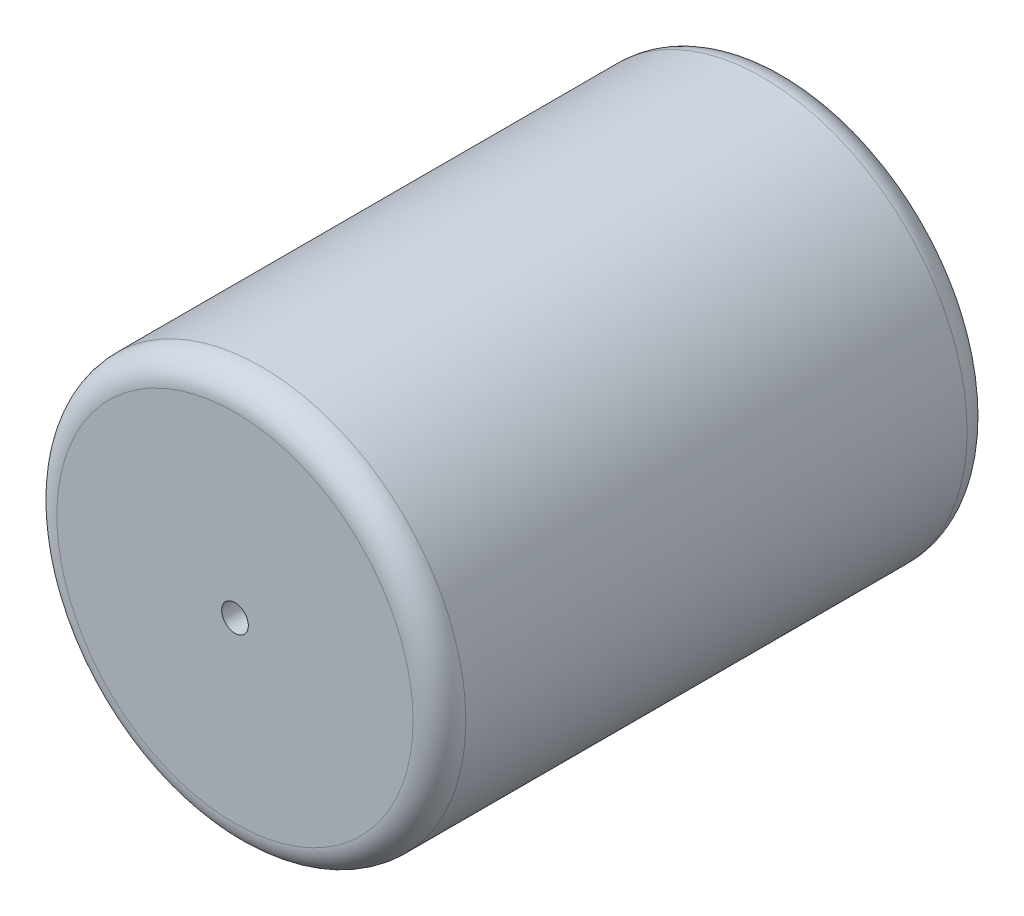
ISO-10303-21;
HEADER;
FILE_DESCRIPTION(('STEP AP214'),'2;1');
FILE_NAME('part.step','',(''),(''),'','','');
FILE_SCHEMA(('AUTOMOTIVE_DESIGN { 1 0 10303 214 1 1 1 1 }'));
ENDSEC;
DATA;
#1=APPLICATION_CONTEXT('core data for automotive mechanical design processes');
#2=APPLICATION_PROTOCOL_DEFINITION('international standard','automotive_design',2000,#1);
#3=PRODUCT_CONTEXT('',#1,'mechanical');
#4=PRODUCT('Part','Part','',(#3));
#5=PRODUCT_RELATED_PRODUCT_CATEGORY('part','',(#4));
#6=PRODUCT_DEFINITION_FORMATION('','',#4);
#7=PRODUCT_DEFINITION_CONTEXT('part definition',#1,'design');
#8=PRODUCT_DEFINITION('design','',#6,#7);
#9=PRODUCT_DEFINITION_SHAPE('','',#8);
#10=(LENGTH_UNIT() NAMED_UNIT(*) SI_UNIT(.MILLI.,.METRE.));
#11=(NAMED_UNIT(*) PLANE_ANGLE_UNIT() SI_UNIT($,.RADIAN.));
#12=(NAMED_UNIT(*) SI_UNIT($,.STERADIAN.) SOLID_ANGLE_UNIT());
#13=UNCERTAINTY_MEASURE_WITH_UNIT(LENGTH_MEASURE(1.E-05),#10,'distance_accuracy_value','');
#14=(GEOMETRIC_REPRESENTATION_CONTEXT(3) GLOBAL_UNCERTAINTY_ASSIGNED_CONTEXT((#13)) GLOBAL_UNIT_ASSIGNED_CONTEXT((#10,
#11,#12)) REPRESENTATION_CONTEXT('',''));
#15=CARTESIAN_POINT('',(0.,0.,0.));
#16=DIRECTION('',(0.,0.,1.));
#17=DIRECTION('',(1.,0.,0.));
#18=AXIS2_PLACEMENT_3D('',#15,#16,#17);
#19=CARTESIAN_POINT('',(0.,0.,21.));
#20=DIRECTION('',(0.,0.,-1.));
#21=DIRECTION('',(-1.,0.,0.));
#22=AXIS2_PLACEMENT_3D('',#19,#20,#21);
#23=CYLINDRICAL_SURFACE('',#22,7.75);
#24=CARTESIAN_POINT('',(0.,0.,20.));
#25=DIRECTION('',(0.,0.,1.));
#26=DIRECTION('',(1.,0.,0.));
#27=AXIS2_PLACEMENT_3D('',#24,#25,#26);
#28=CIRCLE('',#27,7.75);
#29=CARTESIAN_POINT('',(7.75,0.,20.));
#30=VERTEX_POINT('',#29);
#31=EDGE_CURVE('E40',#30,#30,#28,.F.);
#32=ORIENTED_EDGE('',*,*,#31,.T.);
#33=EDGE_LOOP('',(#32));
#34=FACE_BOUND('',#33,.T.);
#35=CARTESIAN_POINT('',(0.,0.,1.));
#36=DIRECTION('',(0.,0.,1.));
#37=DIRECTION('',(1.,0.,0.));
#38=AXIS2_PLACEMENT_3D('',#35,#36,#37);
#39=CIRCLE('',#38,7.75);
#40=CARTESIAN_POINT('',(7.75,0.,1.));
#41=VERTEX_POINT('',#40);
#42=EDGE_CURVE('E44',#41,#41,#39,.T.);
#43=ORIENTED_EDGE('',*,*,#42,.T.);
#44=EDGE_LOOP('',(#43));
#45=FACE_BOUND('',#44,.T.);
#46=ADVANCED_FACE('F32',(#34,#45),#23,.T.);
#47=CARTESIAN_POINT('',(0.,0.,21.));
#48=DIRECTION('',(0.,0.,1.));
#49=DIRECTION('',(1.,0.,0.));
#50=AXIS2_PLACEMENT_3D('',#47,#48,#49);
#51=PLANE('',#50);
#52=CARTESIAN_POINT('',(0.,0.,21.));
#53=DIRECTION('',(0.,0.,1.));
#54=DIRECTION('',(1.,0.,0.));
#55=AXIS2_PLACEMENT_3D('',#52,#53,#54);
#56=CIRCLE('',#55,0.505);
#57=CARTESIAN_POINT('',(0.505,0.,21.));
#58=VERTEX_POINT('',#57);
#59=EDGE_CURVE('E52',#58,#58,#56,.T.);
#60=ORIENTED_EDGE('',*,*,#59,.F.);
#61=EDGE_LOOP('',(#60));
#62=FACE_BOUND('',#61,.T.);
#63=CARTESIAN_POINT('',(0.,0.,21.));
#64=DIRECTION('',(0.,0.,1.));
#65=DIRECTION('',(1.,0.,0.));
#66=AXIS2_PLACEMENT_3D('',#63,#64,#65);
#67=CIRCLE('',#66,6.75);
#68=CARTESIAN_POINT('',(6.75,0.,21.));
#69=VERTEX_POINT('',#68);
#70=EDGE_CURVE('E49',#69,#69,#67,.T.);
#71=ORIENTED_EDGE('',*,*,#70,.T.);
#72=EDGE_LOOP('',(#71));
#73=FACE_BOUND('',#72,.T.);
#74=ADVANCED_FACE('F71',(#62,#73),#51,.T.);
#75=CARTESIAN_POINT('',(0.,0.,0.));
#76=DIRECTION('',(0.,0.,1.));
#77=DIRECTION('',(1.,0.,0.));
#78=AXIS2_PLACEMENT_3D('',#75,#76,#77);
#79=PLANE('',#78);
#80=CARTESIAN_POINT('',(0.,0.,0.));
#81=DIRECTION('',(0.,0.,1.));
#82=DIRECTION('',(1.,0.,0.));
#83=AXIS2_PLACEMENT_3D('',#80,#81,#82);
#84=CIRCLE('',#83,0.505);
#85=CARTESIAN_POINT('',(0.505,0.,0.));
#86=VERTEX_POINT('',#85);
#87=EDGE_CURVE('E36',#86,#86,#84,.T.);
#88=ORIENTED_EDGE('',*,*,#87,.T.);
#89=EDGE_LOOP('',(#88));
#90=FACE_BOUND('',#89,.T.);
#91=CARTESIAN_POINT('',(0.,0.,0.));
#92=DIRECTION('',(0.,0.,1.));
#93=DIRECTION('',(1.,0.,0.));
#94=AXIS2_PLACEMENT_3D('',#91,#92,#93);
#95=CIRCLE('',#94,6.75);
#96=CARTESIAN_POINT('',(6.75,0.,0.));
#97=VERTEX_POINT('',#96);
#98=EDGE_CURVE('E10',#97,#97,#95,.F.);
#99=ORIENTED_EDGE('',*,*,#98,.T.);
#100=EDGE_LOOP('',(#99));
#101=FACE_BOUND('',#100,.T.);
#102=ADVANCED_FACE('F59',(#90,#101),#79,.F.);
#103=CARTESIAN_POINT('',(0.,0.,20.));
#104=DIRECTION('',(0.,0.,1.));
#105=DIRECTION('',(1.,0.,0.));
#106=AXIS2_PLACEMENT_3D('',#103,#104,#105);
#107=TOROIDAL_SURFACE('',#106,6.75,1.);
#108=ORIENTED_EDGE('',*,*,#31,.F.);
#109=EDGE_LOOP('',(#108));
#110=FACE_BOUND('',#109,.T.);
#111=ORIENTED_EDGE('',*,*,#70,.F.);
#112=EDGE_LOOP('',(#111));
#113=FACE_BOUND('',#112,.T.);
#114=ADVANCED_FACE('F67',(#110,#113),#107,.T.);
#115=CARTESIAN_POINT('',(0.,0.,1.));
#116=DIRECTION('',(0.,0.,1.));
#117=DIRECTION('',(1.,0.,0.));
#118=AXIS2_PLACEMENT_3D('',#115,#116,#117);
#119=TOROIDAL_SURFACE('',#118,6.75,1.);
#120=ORIENTED_EDGE('',*,*,#98,.F.);
#121=EDGE_LOOP('',(#120));
#122=FACE_BOUND('',#121,.T.);
#123=ORIENTED_EDGE('',*,*,#42,.F.);
#124=EDGE_LOOP('',(#123));
#125=FACE_BOUND('',#124,.T.);
#126=ADVANCED_FACE('F34',(#122,#125),#119,.T.);
#127=CARTESIAN_POINT('',(0.,0.,-30.7));
#128=DIRECTION('',(0.,0.,1.));
#129=DIRECTION('',(1.,0.,0.));
#130=AXIS2_PLACEMENT_3D('',#127,#128,#129);
#131=CYLINDRICAL_SURFACE('',#130,0.505);
#132=ORIENTED_EDGE('',*,*,#59,.T.);
#133=EDGE_LOOP('',(#132));
#134=FACE_BOUND('',#133,.T.);
#135=ORIENTED_EDGE('',*,*,#87,.F.);
#136=EDGE_LOOP('',(#135));
#137=FACE_BOUND('',#136,.T.);
#138=ADVANCED_FACE('F61',(#134,#137),#131,.F.);
#139=CLOSED_SHELL('',(#46,#74,#102,#114,#126,#138));
#140=MANIFOLD_SOLID_BREP('B2',#139);
#141=ADVANCED_BREP_SHAPE_REPRESENTATION('',(#18,#140),#14);
#142=SHAPE_DEFINITION_REPRESENTATION(#9,#141);
ENDSEC;
END-ISO-10303-21;
